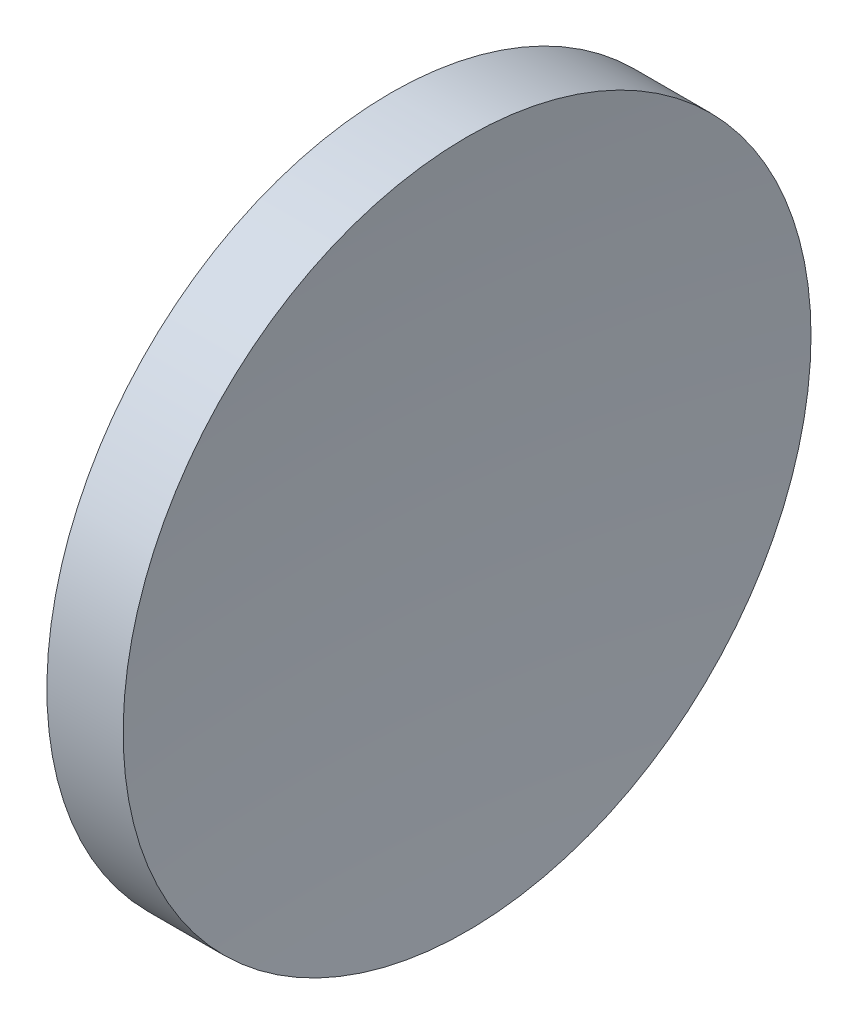
ISO-10303-21;
HEADER;
FILE_DESCRIPTION(('STEP AP214'),'2;1');
FILE_NAME('part.step','',(''),(''),'','','');
FILE_SCHEMA(('AUTOMOTIVE_DESIGN { 1 0 10303 214 1 1 1 1 }'));
ENDSEC;
DATA;
#1=APPLICATION_CONTEXT('core data for automotive mechanical design processes');
#2=APPLICATION_PROTOCOL_DEFINITION('international standard','automotive_design',2000,#1);
#3=PRODUCT_CONTEXT('',#1,'mechanical');
#4=PRODUCT('Part','Part','',(#3));
#5=PRODUCT_RELATED_PRODUCT_CATEGORY('part','',(#4));
#6=PRODUCT_DEFINITION_FORMATION('','',#4);
#7=PRODUCT_DEFINITION_CONTEXT('part definition',#1,'design');
#8=PRODUCT_DEFINITION('design','',#6,#7);
#9=PRODUCT_DEFINITION_SHAPE('','',#8);
#10=(LENGTH_UNIT() NAMED_UNIT(*) SI_UNIT(.MILLI.,.METRE.));
#11=(NAMED_UNIT(*) PLANE_ANGLE_UNIT() SI_UNIT($,.RADIAN.));
#12=(NAMED_UNIT(*) SI_UNIT($,.STERADIAN.) SOLID_ANGLE_UNIT());
#13=UNCERTAINTY_MEASURE_WITH_UNIT(LENGTH_MEASURE(1.E-05),#10,'distance_accuracy_value','');
#14=(GEOMETRIC_REPRESENTATION_CONTEXT(3) GLOBAL_UNCERTAINTY_ASSIGNED_CONTEXT((#13)) GLOBAL_UNIT_ASSIGNED_CONTEXT((#10,
#11,#12)) REPRESENTATION_CONTEXT('',''));
#15=CARTESIAN_POINT('',(0.,0.,0.));
#16=DIRECTION('',(0.,0.,1.));
#17=DIRECTION('',(1.,0.,0.));
#18=AXIS2_PLACEMENT_3D('',#15,#16,#17);
#19=CARTESIAN_POINT('',(168.345520155767,34.5168962409161,22.1552279145953));
#20=DIRECTION('',(1.,0.,0.));
#21=DIRECTION('',(0.,1.,0.));
#22=AXIS2_PLACEMENT_3D('',#19,#20,#21);
#23=SPHERICAL_SURFACE('',#22,252.9);
#24=CARTESIAN_POINT('',(-83.2757229855865,34.5168962409161,22.1552279145953));
#25=DIRECTION('',(1.,0.,0.));
#26=DIRECTION('',(0.,0.,-1.));
#27=AXIS2_PLACEMENT_3D('',#24,#25,#26);
#28=CIRCLE('',#27,25.4);
#29=CARTESIAN_POINT('',(-83.2757229855865,34.5168962409161,-3.24477208540466));
#30=VERTEX_POINT('',#29);
#31=EDGE_CURVE('E8',#30,#30,#28,.T.);
#32=ORIENTED_EDGE('',*,*,#31,.T.);
#33=EDGE_LOOP('',(#32));
#34=FACE_BOUND('',#33,.T.);
#35=ADVANCED_FACE('F13',(#34),#23,.F.);
#36=CARTESIAN_POINT('',(-84.5544798442333,34.5168962409161,22.1552279145953));
#37=DIRECTION('',(1.,0.,0.));
#38=DIRECTION('',(0.,0.,-1.));
#39=AXIS2_PLACEMENT_3D('',#36,#37,#38);
#40=CYLINDRICAL_SURFACE('',#39,25.4);
#41=CARTESIAN_POINT('',(-88.9089030748681,34.5168962409161,22.1552279145953));
#42=DIRECTION('',(1.,0.,0.));
#43=DIRECTION('',(0.,0.,-1.));
#44=AXIS2_PLACEMENT_3D('',#41,#42,#43);
#45=CIRCLE('',#44,25.4000000000001);
#46=CARTESIAN_POINT('',(-88.9089030748681,34.5168962409161,-3.24477208540474));
#47=VERTEX_POINT('',#46);
#48=EDGE_CURVE('E19',#47,#47,#45,.T.);
#49=ORIENTED_EDGE('',*,*,#48,.T.);
#50=EDGE_LOOP('',(#49));
#51=FACE_BOUND('',#50,.T.);
#52=ORIENTED_EDGE('',*,*,#31,.F.);
#53=EDGE_LOOP('',(#52));
#54=FACE_BOUND('',#53,.T.);
#55=ADVANCED_FACE('F25',(#51,#54),#40,.T.);
#56=CARTESIAN_POINT('',(410.445520155767,34.5168962409161,22.1552279145953));
#57=DIRECTION('',(1.,0.,0.));
#58=DIRECTION('',(0.,1.,0.));
#59=AXIS2_PLACEMENT_3D('',#56,#57,#58);
#60=SPHERICAL_SURFACE('',#59,500.);
#61=ORIENTED_EDGE('',*,*,#48,.F.);
#62=EDGE_LOOP('',(#61));
#63=FACE_BOUND('',#62,.T.);
#64=ADVANCED_FACE('F28',(#63),#60,.T.);
#65=CLOSED_SHELL('',(#35,#55,#64));
#66=MANIFOLD_SOLID_BREP('B1',#65);
#67=ADVANCED_BREP_SHAPE_REPRESENTATION('',(#18,#66),#14);
#68=SHAPE_DEFINITION_REPRESENTATION(#9,#67);
ENDSEC;
END-ISO-10303-21;
